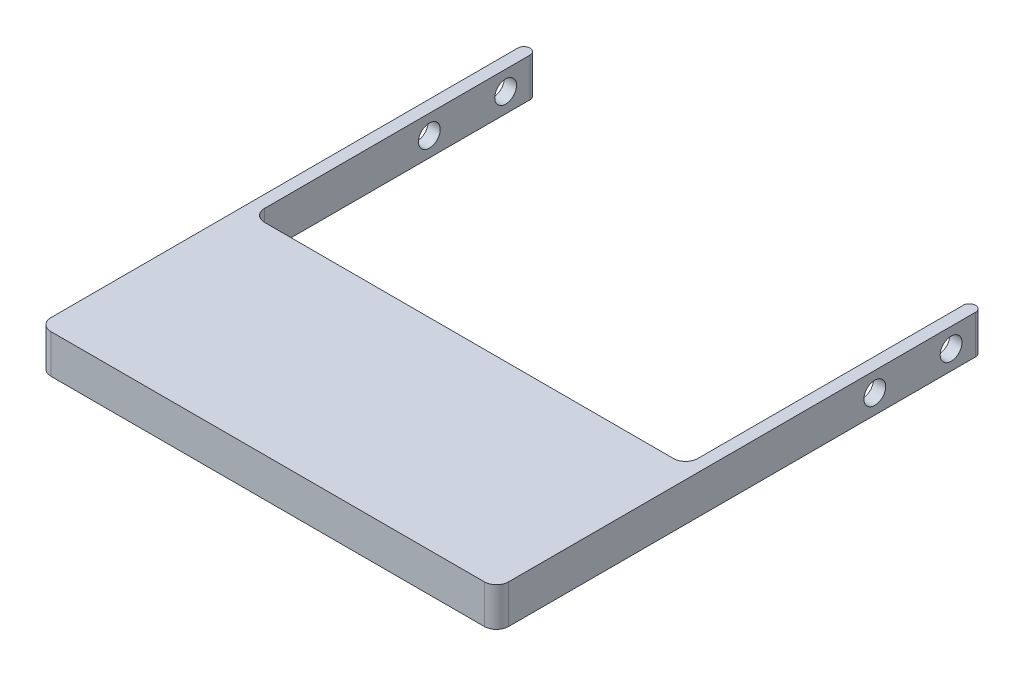
ISO-10303-21;
HEADER;
FILE_DESCRIPTION(('STEP AP214'),'2;1');
FILE_NAME('part.step','',(''),(''),'','','');
FILE_SCHEMA(('AUTOMOTIVE_DESIGN { 1 0 10303 214 1 1 1 1 }'));
ENDSEC;
DATA;
#1=APPLICATION_CONTEXT('core data for automotive mechanical design processes');
#2=APPLICATION_PROTOCOL_DEFINITION('international standard','automotive_design',2000,#1);
#3=PRODUCT_CONTEXT('',#1,'mechanical');
#4=PRODUCT('Part','Part','',(#3));
#5=PRODUCT_RELATED_PRODUCT_CATEGORY('part','',(#4));
#6=PRODUCT_DEFINITION_FORMATION('','',#4);
#7=PRODUCT_DEFINITION_CONTEXT('part definition',#1,'design');
#8=PRODUCT_DEFINITION('design','',#6,#7);
#9=PRODUCT_DEFINITION_SHAPE('','',#8);
#10=(LENGTH_UNIT() NAMED_UNIT(*) SI_UNIT(.MILLI.,.METRE.));
#11=(NAMED_UNIT(*) PLANE_ANGLE_UNIT() SI_UNIT($,.RADIAN.));
#12=(NAMED_UNIT(*) SI_UNIT($,.STERADIAN.) SOLID_ANGLE_UNIT());
#13=UNCERTAINTY_MEASURE_WITH_UNIT(LENGTH_MEASURE(1.E-05),#10,'distance_accuracy_value','');
#14=(GEOMETRIC_REPRESENTATION_CONTEXT(3) GLOBAL_UNCERTAINTY_ASSIGNED_CONTEXT((#13)) GLOBAL_UNIT_ASSIGNED_CONTEXT((#10,
#11,#12)) REPRESENTATION_CONTEXT('',''));
#15=CARTESIAN_POINT('',(0.,0.,0.));
#16=DIRECTION('',(0.,0.,1.));
#17=DIRECTION('',(1.,0.,0.));
#18=AXIS2_PLACEMENT_3D('',#15,#16,#17);
#19=CARTESIAN_POINT('',(71.,6.35,128.));
#20=DIRECTION('',(1.,0.,0.));
#21=DIRECTION('',(0.,0.,-1.));
#22=AXIS2_PLACEMENT_3D('',#19,#20,#21);
#23=PLANE('',#22);
#24=CARTESIAN_POINT('',(71.,0.,70.));
#25=DIRECTION('',(1.,0.,0.));
#26=DIRECTION('',(0.,0.,-1.));
#27=AXIS2_PLACEMENT_3D('',#24,#25,#26);
#28=CIRCLE('',#27,3.57123999999998);
#29=CARTESIAN_POINT('',(71.,0.,66.42876));
#30=VERTEX_POINT('',#29);
#31=EDGE_CURVE('E477',#30,#30,#28,.T.);
#32=ORIENTED_EDGE('',*,*,#31,.T.);
#33=EDGE_LOOP('',(#32));
#34=FACE_BOUND('',#33,.T.);
#35=CARTESIAN_POINT('',(71.,0.,45.));
#36=DIRECTION('',(1.,0.,0.));
#37=DIRECTION('',(0.,0.,-1.));
#38=AXIS2_PLACEMENT_3D('',#35,#36,#37);
#39=CIRCLE('',#38,3.57123999999998);
#40=CARTESIAN_POINT('',(71.,0.,41.42876));
#41=VERTEX_POINT('',#40);
#42=EDGE_CURVE('E236',#41,#41,#39,.T.);
#43=ORIENTED_EDGE('',*,*,#42,.T.);
#44=EDGE_LOOP('',(#43));
#45=FACE_BOUND('',#44,.T.);
#46=DIRECTION('',(0.,0.,1.));
#47=VECTOR('',#46,1.);
#48=CARTESIAN_POINT('',(71.,6.35,128.));
#49=LINE('',#48,#47);
#50=CARTESIAN_POINT('',(71.,6.35,37.));
#51=VERTEX_POINT('',#50);
#52=CARTESIAN_POINT('',(71.,6.35,124.));
#53=VERTEX_POINT('',#52);
#54=EDGE_CURVE('E167',#51,#53,#49,.T.);
#55=ORIENTED_EDGE('',*,*,#54,.F.);
#56=DIRECTION('',(0.,-1.,0.));
#57=VECTOR('',#56,1.);
#58=CARTESIAN_POINT('',(71.,6.35,37.));
#59=LINE('',#58,#57);
#60=CARTESIAN_POINT('',(71.,-6.35,37.));
#61=VERTEX_POINT('',#60);
#62=EDGE_CURVE('E204',#51,#61,#59,.T.);
#63=ORIENTED_EDGE('',*,*,#62,.T.);
#64=DIRECTION('',(0.,0.,1.));
#65=VECTOR('',#64,1.);
#66=CARTESIAN_POINT('',(71.,-6.35,128.));
#67=LINE('',#66,#65);
#68=CARTESIAN_POINT('',(71.,-6.35,124.));
#69=VERTEX_POINT('',#68);
#70=EDGE_CURVE('E226',#61,#69,#67,.T.);
#71=ORIENTED_EDGE('',*,*,#70,.T.);
#72=DIRECTION('',(0.,-1.,0.));
#73=VECTOR('',#72,1.);
#74=CARTESIAN_POINT('',(71.,6.35,124.));
#75=LINE('',#74,#73);
#76=EDGE_CURVE('E192',#69,#53,#75,.F.);
#77=ORIENTED_EDGE('',*,*,#76,.T.);
#78=EDGE_LOOP('',(#55,#63,#71,#77));
#79=FACE_BOUND('',#78,.T.);
#80=ADVANCED_FACE('F35',(#34,#45,#79),#23,.F.);
#81=CARTESIAN_POINT('',(71.,6.35,128.));
#82=DIRECTION('',(0.,0.,1.));
#83=DIRECTION('',(1.,0.,0.));
#84=AXIS2_PLACEMENT_3D('',#81,#82,#83);
#85=PLANE('',#84);
#86=DIRECTION('',(-1.,0.,0.));
#87=VECTOR('',#86,1.);
#88=CARTESIAN_POINT('',(71.,-6.35,128.));
#89=LINE('',#88,#87);
#90=CARTESIAN_POINT('',(67.,-6.35,128.));
#91=VERTEX_POINT('',#90);
#92=CARTESIAN_POINT('',(-67.,-6.35,128.));
#93=VERTEX_POINT('',#92);
#94=EDGE_CURVE('E230',#91,#93,#89,.T.);
#95=ORIENTED_EDGE('',*,*,#94,.T.);
#96=DIRECTION('',(0.,-1.,0.));
#97=VECTOR('',#96,1.);
#98=CARTESIAN_POINT('',(-67.,6.35,128.));
#99=LINE('',#98,#97);
#100=CARTESIAN_POINT('',(-67.,6.35,128.));
#101=VERTEX_POINT('',#100);
#102=EDGE_CURVE('E190',#93,#101,#99,.F.);
#103=ORIENTED_EDGE('',*,*,#102,.T.);
#104=DIRECTION('',(-1.,0.,0.));
#105=VECTOR('',#104,1.);
#106=CARTESIAN_POINT('',(71.,6.35,128.));
#107=LINE('',#106,#105);
#108=CARTESIAN_POINT('',(67.,6.35,128.));
#109=VERTEX_POINT('',#108);
#110=EDGE_CURVE('E246',#109,#101,#107,.T.);
#111=ORIENTED_EDGE('',*,*,#110,.F.);
#112=DIRECTION('',(0.,-1.,0.));
#113=VECTOR('',#112,1.);
#114=CARTESIAN_POINT('',(67.,-6.35,128.));
#115=LINE('',#114,#113);
#116=EDGE_CURVE('E187',#109,#91,#115,.T.);
#117=ORIENTED_EDGE('',*,*,#116,.T.);
#118=EDGE_LOOP('',(#95,#103,#111,#117));
#119=FACE_BOUND('',#118,.T.);
#120=ADVANCED_FACE('F299',(#119),#85,.F.);
#121=CARTESIAN_POINT('',(-71.,6.35,128.));
#122=DIRECTION('',(-1.,0.,0.));
#123=DIRECTION('',(0.,0.,1.));
#124=AXIS2_PLACEMENT_3D('',#121,#122,#123);
#125=PLANE('',#124);
#126=CARTESIAN_POINT('',(-71.,0.,70.));
#127=DIRECTION('',(-1.,0.,0.));
#128=DIRECTION('',(0.,0.,1.));
#129=AXIS2_PLACEMENT_3D('',#126,#127,#128);
#130=CIRCLE('',#129,3.57123999999998);
#131=CARTESIAN_POINT('',(-71.,0.,73.57124));
#132=VERTEX_POINT('',#131);
#133=EDGE_CURVE('E476',#132,#132,#130,.T.);
#134=ORIENTED_EDGE('',*,*,#133,.T.);
#135=EDGE_LOOP('',(#134));
#136=FACE_BOUND('',#135,.T.);
#137=CARTESIAN_POINT('',(-71.,0.,45.));
#138=DIRECTION('',(-1.,0.,0.));
#139=DIRECTION('',(0.,0.,1.));
#140=AXIS2_PLACEMENT_3D('',#137,#138,#139);
#141=CIRCLE('',#140,3.57123999999998);
#142=CARTESIAN_POINT('',(-71.,0.,48.57124));
#143=VERTEX_POINT('',#142);
#144=EDGE_CURVE('E232',#143,#143,#141,.T.);
#145=ORIENTED_EDGE('',*,*,#144,.T.);
#146=EDGE_LOOP('',(#145));
#147=FACE_BOUND('',#146,.T.);
#148=DIRECTION('',(0.,0.,-1.));
#149=VECTOR('',#148,1.);
#150=CARTESIAN_POINT('',(-71.,-6.35,128.));
#151=LINE('',#150,#149);
#152=CARTESIAN_POINT('',(-71.,-6.35,124.));
#153=VERTEX_POINT('',#152);
#154=CARTESIAN_POINT('',(-71.,-6.35,37.));
#155=VERTEX_POINT('',#154);
#156=EDGE_CURVE('E169',#153,#155,#151,.T.);
#157=ORIENTED_EDGE('',*,*,#156,.T.);
#158=DIRECTION('',(0.,-1.,0.));
#159=VECTOR('',#158,1.);
#160=CARTESIAN_POINT('',(-71.,6.35,37.));
#161=LINE('',#160,#159);
#162=CARTESIAN_POINT('',(-71.,6.35,37.));
#163=VERTEX_POINT('',#162);
#164=EDGE_CURVE('E44',#155,#163,#161,.F.);
#165=ORIENTED_EDGE('',*,*,#164,.T.);
#166=DIRECTION('',(0.,0.,-1.));
#167=VECTOR('',#166,1.);
#168=CARTESIAN_POINT('',(-71.,6.35,128.));
#169=LINE('',#168,#167);
#170=CARTESIAN_POINT('',(-71.,6.35,124.));
#171=VERTEX_POINT('',#170);
#172=EDGE_CURVE('E249',#171,#163,#169,.T.);
#173=ORIENTED_EDGE('',*,*,#172,.F.);
#174=DIRECTION('',(0.,-1.,0.));
#175=VECTOR('',#174,1.);
#176=CARTESIAN_POINT('',(-71.,-6.35,124.));
#177=LINE('',#176,#175);
#178=EDGE_CURVE('E184',#171,#153,#177,.T.);
#179=ORIENTED_EDGE('',*,*,#178,.T.);
#180=EDGE_LOOP('',(#157,#165,#173,#179));
#181=FACE_BOUND('',#180,.T.);
#182=ADVANCED_FACE('F260',(#136,#147,#181),#125,.F.);
#183=CARTESIAN_POINT('',(-75.,6.35,194.));
#184=DIRECTION('',(1.,0.,0.));
#185=DIRECTION('',(0.,0.,-1.));
#186=AXIS2_PLACEMENT_3D('',#183,#184,#185);
#187=PLANE('',#186);
#188=CARTESIAN_POINT('',(-75.,0.,70.));
#189=DIRECTION('',(1.,0.,0.));
#190=DIRECTION('',(0.,0.,-1.));
#191=AXIS2_PLACEMENT_3D('',#188,#189,#190);
#192=CIRCLE('',#191,3.57123999999996);
#193=CARTESIAN_POINT('',(-75.,0.,66.42876));
#194=VERTEX_POINT('',#193);
#195=EDGE_CURVE('E473',#194,#194,#192,.T.);
#196=ORIENTED_EDGE('',*,*,#195,.T.);
#197=EDGE_LOOP('',(#196));
#198=FACE_BOUND('',#197,.T.);
#199=CARTESIAN_POINT('',(-75.,0.,45.));
#200=DIRECTION('',(1.,0.,0.));
#201=DIRECTION('',(0.,0.,-1.));
#202=AXIS2_PLACEMENT_3D('',#199,#200,#201);
#203=CIRCLE('',#202,3.57123999999996);
#204=CARTESIAN_POINT('',(-75.,0.,41.42876));
#205=VERTEX_POINT('',#204);
#206=EDGE_CURVE('E241',#205,#205,#203,.T.);
#207=ORIENTED_EDGE('',*,*,#206,.T.);
#208=EDGE_LOOP('',(#207));
#209=FACE_BOUND('',#208,.T.);
#210=DIRECTION('',(0.,0.,1.));
#211=VECTOR('',#210,1.);
#212=CARTESIAN_POINT('',(-75.,6.35,194.));
#213=LINE('',#212,#211);
#214=CARTESIAN_POINT('',(-75.,6.35,37.));
#215=VERTEX_POINT('',#214);
#216=CARTESIAN_POINT('',(-75.,6.35,190.));
#217=VERTEX_POINT('',#216);
#218=EDGE_CURVE('E251',#215,#217,#213,.T.);
#219=ORIENTED_EDGE('',*,*,#218,.F.);
#220=DIRECTION('',(0.,-1.,0.));
#221=VECTOR('',#220,1.);
#222=CARTESIAN_POINT('',(-75.,6.35,37.));
#223=LINE('',#222,#221);
#224=CARTESIAN_POINT('',(-75.,-6.35,37.));
#225=VERTEX_POINT('',#224);
#226=EDGE_CURVE('E11',#215,#225,#223,.T.);
#227=ORIENTED_EDGE('',*,*,#226,.T.);
#228=DIRECTION('',(0.,0.,1.));
#229=VECTOR('',#228,1.);
#230=CARTESIAN_POINT('',(-75.,-6.35,194.));
#231=LINE('',#230,#229);
#232=CARTESIAN_POINT('',(-75.,-6.35,190.));
#233=VERTEX_POINT('',#232);
#234=EDGE_CURVE('E164',#225,#233,#231,.T.);
#235=ORIENTED_EDGE('',*,*,#234,.T.);
#236=DIRECTION('',(0.,-1.,0.));
#237=VECTOR('',#236,1.);
#238=CARTESIAN_POINT('',(-75.,6.35,190.));
#239=LINE('',#238,#237);
#240=EDGE_CURVE('E144',#233,#217,#239,.F.);
#241=ORIENTED_EDGE('',*,*,#240,.T.);
#242=EDGE_LOOP('',(#219,#227,#235,#241));
#243=FACE_BOUND('',#242,.T.);
#244=ADVANCED_FACE('F270',(#198,#209,#243),#187,.F.);
#245=CARTESIAN_POINT('',(75.,6.35,194.));
#246=DIRECTION('',(0.,0.,-1.));
#247=DIRECTION('',(-1.,0.,0.));
#248=AXIS2_PLACEMENT_3D('',#245,#246,#247);
#249=PLANE('',#248);
#250=DIRECTION('',(1.,0.,0.));
#251=VECTOR('',#250,1.);
#252=CARTESIAN_POINT('',(75.,6.35,194.));
#253=LINE('',#252,#251);
#254=CARTESIAN_POINT('',(-71.,6.35,194.));
#255=VERTEX_POINT('',#254);
#256=CARTESIAN_POINT('',(71.,6.35,194.));
#257=VERTEX_POINT('',#256);
#258=EDGE_CURVE('E157',#255,#257,#253,.T.);
#259=ORIENTED_EDGE('',*,*,#258,.F.);
#260=DIRECTION('',(0.,-1.,0.));
#261=VECTOR('',#260,1.);
#262=CARTESIAN_POINT('',(-71.,6.35,194.));
#263=LINE('',#262,#261);
#264=CARTESIAN_POINT('',(-71.,-6.35,194.));
#265=VERTEX_POINT('',#264);
#266=EDGE_CURVE('E142',#255,#265,#263,.T.);
#267=ORIENTED_EDGE('',*,*,#266,.T.);
#268=DIRECTION('',(1.,0.,0.));
#269=VECTOR('',#268,1.);
#270=CARTESIAN_POINT('',(75.,-6.35,194.));
#271=LINE('',#270,#269);
#272=CARTESIAN_POINT('',(71.,-6.35,194.));
#273=VERTEX_POINT('',#272);
#274=EDGE_CURVE('E154',#265,#273,#271,.T.);
#275=ORIENTED_EDGE('',*,*,#274,.T.);
#276=DIRECTION('',(0.,-1.,0.));
#277=VECTOR('',#276,1.);
#278=CARTESIAN_POINT('',(71.,6.35,194.));
#279=LINE('',#278,#277);
#280=EDGE_CURVE('E158',#273,#257,#279,.F.);
#281=ORIENTED_EDGE('',*,*,#280,.T.);
#282=EDGE_LOOP('',(#259,#267,#275,#281));
#283=FACE_BOUND('',#282,.T.);
#284=ADVANCED_FACE('F153',(#283),#249,.F.);
#285=CARTESIAN_POINT('',(75.,6.35,194.));
#286=DIRECTION('',(-1.,0.,0.));
#287=DIRECTION('',(0.,0.,1.));
#288=AXIS2_PLACEMENT_3D('',#285,#286,#287);
#289=PLANE('',#288);
#290=CARTESIAN_POINT('',(75.,0.,70.));
#291=DIRECTION('',(1.,0.,0.));
#292=DIRECTION('',(0.,0.,-1.));
#293=AXIS2_PLACEMENT_3D('',#290,#291,#292);
#294=CIRCLE('',#293,3.57123999999999);
#295=CARTESIAN_POINT('',(75.,0.,66.42876));
#296=VERTEX_POINT('',#295);
#297=EDGE_CURVE('E481',#296,#296,#294,.T.);
#298=ORIENTED_EDGE('',*,*,#297,.F.);
#299=EDGE_LOOP('',(#298));
#300=FACE_BOUND('',#299,.T.);
#301=CARTESIAN_POINT('',(75.,0.,45.));
#302=DIRECTION('',(1.,0.,0.));
#303=DIRECTION('',(0.,0.,-1.));
#304=AXIS2_PLACEMENT_3D('',#301,#302,#303);
#305=CIRCLE('',#304,3.57123999999999);
#306=CARTESIAN_POINT('',(75.,0.,41.42876));
#307=VERTEX_POINT('',#306);
#308=EDGE_CURVE('E479',#307,#307,#305,.T.);
#309=ORIENTED_EDGE('',*,*,#308,.F.);
#310=EDGE_LOOP('',(#309));
#311=FACE_BOUND('',#310,.T.);
#312=DIRECTION('',(0.,0.,-1.));
#313=VECTOR('',#312,1.);
#314=CARTESIAN_POINT('',(75.,-6.35,194.));
#315=LINE('',#314,#313);
#316=CARTESIAN_POINT('',(75.,-6.35,190.));
#317=VERTEX_POINT('',#316);
#318=CARTESIAN_POINT('',(75.,-6.35,37.));
#319=VERTEX_POINT('',#318);
#320=EDGE_CURVE('E163',#317,#319,#315,.T.);
#321=ORIENTED_EDGE('',*,*,#320,.T.);
#322=DIRECTION('',(0.,-1.,0.));
#323=VECTOR('',#322,1.);
#324=CARTESIAN_POINT('',(75.,6.35,37.));
#325=LINE('',#324,#323);
#326=CARTESIAN_POINT('',(75.,6.35,37.));
#327=VERTEX_POINT('',#326);
#328=EDGE_CURVE('E222',#319,#327,#325,.F.);
#329=ORIENTED_EDGE('',*,*,#328,.T.);
#330=DIRECTION('',(0.,0.,-1.));
#331=VECTOR('',#330,1.);
#332=CARTESIAN_POINT('',(75.,6.35,194.));
#333=LINE('',#332,#331);
#334=CARTESIAN_POINT('',(75.,6.35,190.));
#335=VERTEX_POINT('',#334);
#336=EDGE_CURVE('E173',#335,#327,#333,.T.);
#337=ORIENTED_EDGE('',*,*,#336,.F.);
#338=DIRECTION('',(0.,-1.,0.));
#339=VECTOR('',#338,1.);
#340=CARTESIAN_POINT('',(75.,6.35,190.));
#341=LINE('',#340,#339);
#342=EDGE_CURVE('E181',#335,#317,#341,.T.);
#343=ORIENTED_EDGE('',*,*,#342,.T.);
#344=EDGE_LOOP('',(#321,#329,#337,#343));
#345=FACE_BOUND('',#344,.T.);
#346=ADVANCED_FACE('F277',(#300,#311,#345),#289,.F.);
#347=CARTESIAN_POINT('',(71.,6.35,35.));
#348=DIRECTION('',(0.,-1.,0.));
#349=DIRECTION('',(0.,0.,-1.));
#350=AXIS2_PLACEMENT_3D('',#347,#348,#349);
#351=PLANE('',#350);
#352=CARTESIAN_POINT('',(73.,6.35,37.));
#353=DIRECTION('',(0.,-1.,0.));
#354=DIRECTION('',(0.,0.,-1.));
#355=AXIS2_PLACEMENT_3D('',#352,#353,#354);
#356=CIRCLE('',#355,2.);
#357=CARTESIAN_POINT('',(73.,6.35,35.));
#358=VERTEX_POINT('',#357);
#359=EDGE_CURVE('E218',#327,#358,#356,.F.);
#360=ORIENTED_EDGE('',*,*,#359,.T.);
#361=CARTESIAN_POINT('',(73.,6.35,37.));
#362=DIRECTION('',(0.,-1.,0.));
#363=DIRECTION('',(0.,0.,-1.));
#364=AXIS2_PLACEMENT_3D('',#361,#362,#363);
#365=CIRCLE('',#364,2.);
#366=EDGE_CURVE('E220',#358,#51,#365,.F.);
#367=ORIENTED_EDGE('',*,*,#366,.T.);
#368=ORIENTED_EDGE('',*,*,#54,.T.);
#369=CARTESIAN_POINT('',(67.,6.35,124.));
#370=DIRECTION('',(0.,-1.,0.));
#371=DIRECTION('',(0.,0.,-1.));
#372=AXIS2_PLACEMENT_3D('',#369,#370,#371);
#373=CIRCLE('',#372,4.);
#374=EDGE_CURVE('E202',#53,#109,#373,.T.);
#375=ORIENTED_EDGE('',*,*,#374,.T.);
#376=ORIENTED_EDGE('',*,*,#110,.T.);
#377=CARTESIAN_POINT('',(-67.,6.35,124.));
#378=DIRECTION('',(0.,-1.,0.));
#379=DIRECTION('',(0.,0.,-1.));
#380=AXIS2_PLACEMENT_3D('',#377,#378,#379);
#381=CIRCLE('',#380,4.);
#382=EDGE_CURVE('E197',#101,#171,#381,.T.);
#383=ORIENTED_EDGE('',*,*,#382,.T.);
#384=ORIENTED_EDGE('',*,*,#172,.T.);
#385=CARTESIAN_POINT('',(-73.,6.35,37.));
#386=DIRECTION('',(0.,-1.,0.));
#387=DIRECTION('',(0.,0.,-1.));
#388=AXIS2_PLACEMENT_3D('',#385,#386,#387);
#389=CIRCLE('',#388,2.);
#390=CARTESIAN_POINT('',(-73.,6.35,35.));
#391=VERTEX_POINT('',#390);
#392=EDGE_CURVE('E52',#163,#391,#389,.F.);
#393=ORIENTED_EDGE('',*,*,#392,.T.);
#394=CARTESIAN_POINT('',(-73.,6.35,37.));
#395=DIRECTION('',(0.,-1.,0.));
#396=DIRECTION('',(0.,0.,-1.));
#397=AXIS2_PLACEMENT_3D('',#394,#395,#396);
#398=CIRCLE('',#397,2.);
#399=EDGE_CURVE('E215',#391,#215,#398,.F.);
#400=ORIENTED_EDGE('',*,*,#399,.T.);
#401=ORIENTED_EDGE('',*,*,#218,.T.);
#402=CARTESIAN_POINT('',(-71.,6.35,190.));
#403=DIRECTION('',(0.,-1.,0.));
#404=DIRECTION('',(0.,0.,-1.));
#405=AXIS2_PLACEMENT_3D('',#402,#403,#404);
#406=CIRCLE('',#405,4.);
#407=EDGE_CURVE('E179',#217,#255,#406,.F.);
#408=ORIENTED_EDGE('',*,*,#407,.T.);
#409=ORIENTED_EDGE('',*,*,#258,.T.);
#410=CARTESIAN_POINT('',(71.,6.35,190.));
#411=DIRECTION('',(0.,-1.,0.));
#412=DIRECTION('',(0.,0.,-1.));
#413=AXIS2_PLACEMENT_3D('',#410,#411,#412);
#414=CIRCLE('',#413,4.);
#415=EDGE_CURVE('E177',#257,#335,#414,.F.);
#416=ORIENTED_EDGE('',*,*,#415,.T.);
#417=ORIENTED_EDGE('',*,*,#336,.T.);
#418=EDGE_LOOP('',(#360,#367,#368,#375,#376,#383,#384,#393,#400,#401,#408,#409,#416,#417));
#419=FACE_BOUND('',#418,.T.);
#420=ADVANCED_FACE('F268',(#419),#351,.F.);
#421=CARTESIAN_POINT('',(71.,-6.35,35.));
#422=DIRECTION('',(0.,-1.,0.));
#423=DIRECTION('',(0.,0.,-1.));
#424=AXIS2_PLACEMENT_3D('',#421,#422,#423);
#425=PLANE('',#424);
#426=ORIENTED_EDGE('',*,*,#70,.F.);
#427=CARTESIAN_POINT('',(73.,-6.35,37.));
#428=DIRECTION('',(0.,-1.,0.));
#429=DIRECTION('',(0.,0.,-1.));
#430=AXIS2_PLACEMENT_3D('',#427,#428,#429);
#431=CIRCLE('',#430,2.);
#432=CARTESIAN_POINT('',(73.,-6.35,35.));
#433=VERTEX_POINT('',#432);
#434=EDGE_CURVE('E213',#61,#433,#431,.T.);
#435=ORIENTED_EDGE('',*,*,#434,.T.);
#436=CARTESIAN_POINT('',(73.,-6.35,37.));
#437=DIRECTION('',(0.,-1.,0.));
#438=DIRECTION('',(0.,0.,-1.));
#439=AXIS2_PLACEMENT_3D('',#436,#437,#438);
#440=CIRCLE('',#439,2.);
#441=EDGE_CURVE('E211',#433,#319,#440,.T.);
#442=ORIENTED_EDGE('',*,*,#441,.T.);
#443=ORIENTED_EDGE('',*,*,#320,.F.);
#444=CARTESIAN_POINT('',(71.,-6.35,190.));
#445=DIRECTION('',(0.,-1.,0.));
#446=DIRECTION('',(0.,0.,-1.));
#447=AXIS2_PLACEMENT_3D('',#444,#445,#446);
#448=CIRCLE('',#447,4.);
#449=EDGE_CURVE('E148',#317,#273,#448,.T.);
#450=ORIENTED_EDGE('',*,*,#449,.T.);
#451=ORIENTED_EDGE('',*,*,#274,.F.);
#452=CARTESIAN_POINT('',(-71.,-6.35,190.));
#453=DIRECTION('',(0.,-1.,0.));
#454=DIRECTION('',(0.,0.,-1.));
#455=AXIS2_PLACEMENT_3D('',#452,#453,#454);
#456=CIRCLE('',#455,4.);
#457=EDGE_CURVE('E138',#265,#233,#456,.T.);
#458=ORIENTED_EDGE('',*,*,#457,.T.);
#459=ORIENTED_EDGE('',*,*,#234,.F.);
#460=CARTESIAN_POINT('',(-73.,-6.35,37.));
#461=DIRECTION('',(0.,-1.,0.));
#462=DIRECTION('',(0.,0.,-1.));
#463=AXIS2_PLACEMENT_3D('',#460,#461,#462);
#464=CIRCLE('',#463,2.);
#465=CARTESIAN_POINT('',(-73.,-6.35,35.));
#466=VERTEX_POINT('',#465);
#467=EDGE_CURVE('E207',#225,#466,#464,.T.);
#468=ORIENTED_EDGE('',*,*,#467,.T.);
#469=CARTESIAN_POINT('',(-73.,-6.35,37.));
#470=DIRECTION('',(0.,-1.,0.));
#471=DIRECTION('',(0.,0.,-1.));
#472=AXIS2_PLACEMENT_3D('',#469,#470,#471);
#473=CIRCLE('',#472,2.);
#474=EDGE_CURVE('E209',#466,#155,#473,.T.);
#475=ORIENTED_EDGE('',*,*,#474,.T.);
#476=ORIENTED_EDGE('',*,*,#156,.F.);
#477=CARTESIAN_POINT('',(-67.,-6.35,124.));
#478=DIRECTION('',(0.,-1.,0.));
#479=DIRECTION('',(0.,0.,-1.));
#480=AXIS2_PLACEMENT_3D('',#477,#478,#479);
#481=CIRCLE('',#480,4.);
#482=EDGE_CURVE('E195',#153,#93,#481,.F.);
#483=ORIENTED_EDGE('',*,*,#482,.T.);
#484=ORIENTED_EDGE('',*,*,#94,.F.);
#485=CARTESIAN_POINT('',(67.,-6.35,124.));
#486=DIRECTION('',(0.,-1.,0.));
#487=DIRECTION('',(0.,0.,-1.));
#488=AXIS2_PLACEMENT_3D('',#485,#486,#487);
#489=CIRCLE('',#488,4.);
#490=EDGE_CURVE('E199',#91,#69,#489,.F.);
#491=ORIENTED_EDGE('',*,*,#490,.T.);
#492=EDGE_LOOP('',(#426,#435,#442,#443,#450,#451,#458,#459,#468,#475,#476,#483,#484,#491));
#493=FACE_BOUND('',#492,.T.);
#494=ADVANCED_FACE('F161',(#493),#425,.T.);
#495=CARTESIAN_POINT('',(-71.,6.35,190.));
#496=DIRECTION('',(0.,-1.,0.));
#497=DIRECTION('',(0.,0.,-1.));
#498=AXIS2_PLACEMENT_3D('',#495,#496,#497);
#499=CYLINDRICAL_SURFACE('',#498,4.);
#500=ORIENTED_EDGE('',*,*,#407,.F.);
#501=ORIENTED_EDGE('',*,*,#240,.F.);
#502=ORIENTED_EDGE('',*,*,#457,.F.);
#503=ORIENTED_EDGE('',*,*,#266,.F.);
#504=EDGE_LOOP('',(#500,#501,#502,#503));
#505=FACE_BOUND('',#504,.T.);
#506=ADVANCED_FACE('F141',(#505),#499,.T.);
#507=CARTESIAN_POINT('',(71.,6.35,190.));
#508=DIRECTION('',(0.,-1.,0.));
#509=DIRECTION('',(0.,0.,-1.));
#510=AXIS2_PLACEMENT_3D('',#507,#508,#509);
#511=CYLINDRICAL_SURFACE('',#510,4.);
#512=ORIENTED_EDGE('',*,*,#415,.F.);
#513=ORIENTED_EDGE('',*,*,#280,.F.);
#514=ORIENTED_EDGE('',*,*,#449,.F.);
#515=ORIENTED_EDGE('',*,*,#342,.F.);
#516=EDGE_LOOP('',(#512,#513,#514,#515));
#517=FACE_BOUND('',#516,.T.);
#518=ADVANCED_FACE('F275',(#517),#511,.T.);
#519=CARTESIAN_POINT('',(-67.,6.35,124.));
#520=DIRECTION('',(0.,1.,0.));
#521=DIRECTION('',(0.,0.,1.));
#522=AXIS2_PLACEMENT_3D('',#519,#520,#521);
#523=CYLINDRICAL_SURFACE('',#522,4.);
#524=ORIENTED_EDGE('',*,*,#382,.F.);
#525=ORIENTED_EDGE('',*,*,#102,.F.);
#526=ORIENTED_EDGE('',*,*,#482,.F.);
#527=ORIENTED_EDGE('',*,*,#178,.F.);
#528=EDGE_LOOP('',(#524,#525,#526,#527));
#529=FACE_BOUND('',#528,.T.);
#530=ADVANCED_FACE('F315',(#529),#523,.F.);
#531=CARTESIAN_POINT('',(67.,6.35,124.));
#532=DIRECTION('',(0.,1.,0.));
#533=DIRECTION('',(0.,0.,1.));
#534=AXIS2_PLACEMENT_3D('',#531,#532,#533);
#535=CYLINDRICAL_SURFACE('',#534,4.);
#536=ORIENTED_EDGE('',*,*,#374,.F.);
#537=ORIENTED_EDGE('',*,*,#76,.F.);
#538=ORIENTED_EDGE('',*,*,#490,.F.);
#539=ORIENTED_EDGE('',*,*,#116,.F.);
#540=EDGE_LOOP('',(#536,#537,#538,#539));
#541=FACE_BOUND('',#540,.T.);
#542=ADVANCED_FACE('F295',(#541),#535,.F.);
#543=CARTESIAN_POINT('',(73.,6.35,37.));
#544=DIRECTION('',(0.,-1.,0.));
#545=DIRECTION('',(0.,0.,-1.));
#546=AXIS2_PLACEMENT_3D('',#543,#544,#545);
#547=CYLINDRICAL_SURFACE('',#546,2.);
#548=DIRECTION('',(0.,-1.,0.));
#549=VECTOR('',#548,1.);
#550=CARTESIAN_POINT('',(73.,6.35,35.));
#551=LINE('',#550,#549);
#552=EDGE_CURVE('E224',#358,#433,#551,.T.);
#553=ORIENTED_EDGE('',*,*,#552,.F.);
#554=ORIENTED_EDGE('',*,*,#359,.F.);
#555=ORIENTED_EDGE('',*,*,#328,.F.);
#556=ORIENTED_EDGE('',*,*,#441,.F.);
#557=EDGE_LOOP('',(#553,#554,#555,#556));
#558=FACE_BOUND('',#557,.T.);
#559=ADVANCED_FACE('F281',(#558),#547,.T.);
#560=CARTESIAN_POINT('',(73.,6.35,37.));
#561=DIRECTION('',(0.,-1.,0.));
#562=DIRECTION('',(0.,0.,-1.));
#563=AXIS2_PLACEMENT_3D('',#560,#561,#562);
#564=CYLINDRICAL_SURFACE('',#563,2.);
#565=ORIENTED_EDGE('',*,*,#366,.F.);
#566=ORIENTED_EDGE('',*,*,#552,.T.);
#567=ORIENTED_EDGE('',*,*,#434,.F.);
#568=ORIENTED_EDGE('',*,*,#62,.F.);
#569=EDGE_LOOP('',(#565,#566,#567,#568));
#570=FACE_BOUND('',#569,.T.);
#571=ADVANCED_FACE('F288',(#570),#564,.T.);
#572=CARTESIAN_POINT('',(-73.,6.35,37.));
#573=DIRECTION('',(0.,-1.,0.));
#574=DIRECTION('',(0.,0.,-1.));
#575=AXIS2_PLACEMENT_3D('',#572,#573,#574);
#576=CYLINDRICAL_SURFACE('',#575,2.);
#577=ORIENTED_EDGE('',*,*,#226,.F.);
#578=ORIENTED_EDGE('',*,*,#399,.F.);
#579=DIRECTION('',(0.,-1.,0.));
#580=VECTOR('',#579,1.);
#581=CARTESIAN_POINT('',(-73.,6.35,35.));
#582=LINE('',#581,#580);
#583=EDGE_CURVE('E39',#466,#391,#582,.F.);
#584=ORIENTED_EDGE('',*,*,#583,.F.);
#585=ORIENTED_EDGE('',*,*,#467,.F.);
#586=EDGE_LOOP('',(#577,#578,#584,#585));
#587=FACE_BOUND('',#586,.T.);
#588=ADVANCED_FACE('F37',(#587),#576,.T.);
#589=CARTESIAN_POINT('',(-73.,6.35,37.));
#590=DIRECTION('',(0.,-1.,0.));
#591=DIRECTION('',(0.,0.,-1.));
#592=AXIS2_PLACEMENT_3D('',#589,#590,#591);
#593=CYLINDRICAL_SURFACE('',#592,2.);
#594=ORIENTED_EDGE('',*,*,#392,.F.);
#595=ORIENTED_EDGE('',*,*,#164,.F.);
#596=ORIENTED_EDGE('',*,*,#474,.F.);
#597=ORIENTED_EDGE('',*,*,#583,.T.);
#598=EDGE_LOOP('',(#594,#595,#596,#597));
#599=FACE_BOUND('',#598,.T.);
#600=ADVANCED_FACE('F263',(#599),#593,.T.);
#601=CARTESIAN_POINT('',(75.,0.,45.));
#602=DIRECTION('',(1.,0.,0.));
#603=DIRECTION('',(0.,0.,-1.));
#604=AXIS2_PLACEMENT_3D('',#601,#602,#603);
#605=CYLINDRICAL_SURFACE('',#604,3.57123999999998);
#606=ORIENTED_EDGE('',*,*,#308,.T.);
#607=EDGE_LOOP('',(#606));
#608=FACE_BOUND('',#607,.T.);
#609=ORIENTED_EDGE('',*,*,#42,.F.);
#610=EDGE_LOOP('',(#609));
#611=FACE_BOUND('',#610,.T.);
#612=ADVANCED_FACE('F356',(#608,#611),#605,.F.);
#613=ORIENTED_EDGE('',*,*,#206,.F.);
#614=EDGE_LOOP('',(#613));
#615=FACE_BOUND('',#614,.T.);
#616=ORIENTED_EDGE('',*,*,#144,.F.);
#617=EDGE_LOOP('',(#616));
#618=FACE_BOUND('',#617,.T.);
#619=ADVANCED_FACE('F400',(#615,#618),#605,.F.);
#620=CARTESIAN_POINT('',(75.,0.,70.));
#621=DIRECTION('',(1.,0.,0.));
#622=DIRECTION('',(0.,0.,-1.));
#623=AXIS2_PLACEMENT_3D('',#620,#621,#622);
#624=CYLINDRICAL_SURFACE('',#623,3.57123999999998);
#625=ORIENTED_EDGE('',*,*,#297,.T.);
#626=EDGE_LOOP('',(#625));
#627=FACE_BOUND('',#626,.T.);
#628=ORIENTED_EDGE('',*,*,#31,.F.);
#629=EDGE_LOOP('',(#628));
#630=FACE_BOUND('',#629,.T.);
#631=ADVANCED_FACE('F410',(#627,#630),#624,.F.);
#632=ORIENTED_EDGE('',*,*,#195,.F.);
#633=EDGE_LOOP('',(#632));
#634=FACE_BOUND('',#633,.T.);
#635=ORIENTED_EDGE('',*,*,#133,.F.);
#636=EDGE_LOOP('',(#635));
#637=FACE_BOUND('',#636,.T.);
#638=ADVANCED_FACE('F419',(#634,#637),#624,.F.);
#639=CLOSED_SHELL('',(#80,#120,#182,#244,#284,#346,#420,#494,#506,#518,#530,#542,#559,#571,#588,
#600,#612,#619,#631,#638));
#640=MANIFOLD_SOLID_BREP('B2',#639);
#641=ADVANCED_BREP_SHAPE_REPRESENTATION('',(#18,#640),#14);
#642=SHAPE_DEFINITION_REPRESENTATION(#9,#641);
ENDSEC;
END-ISO-10303-21;
